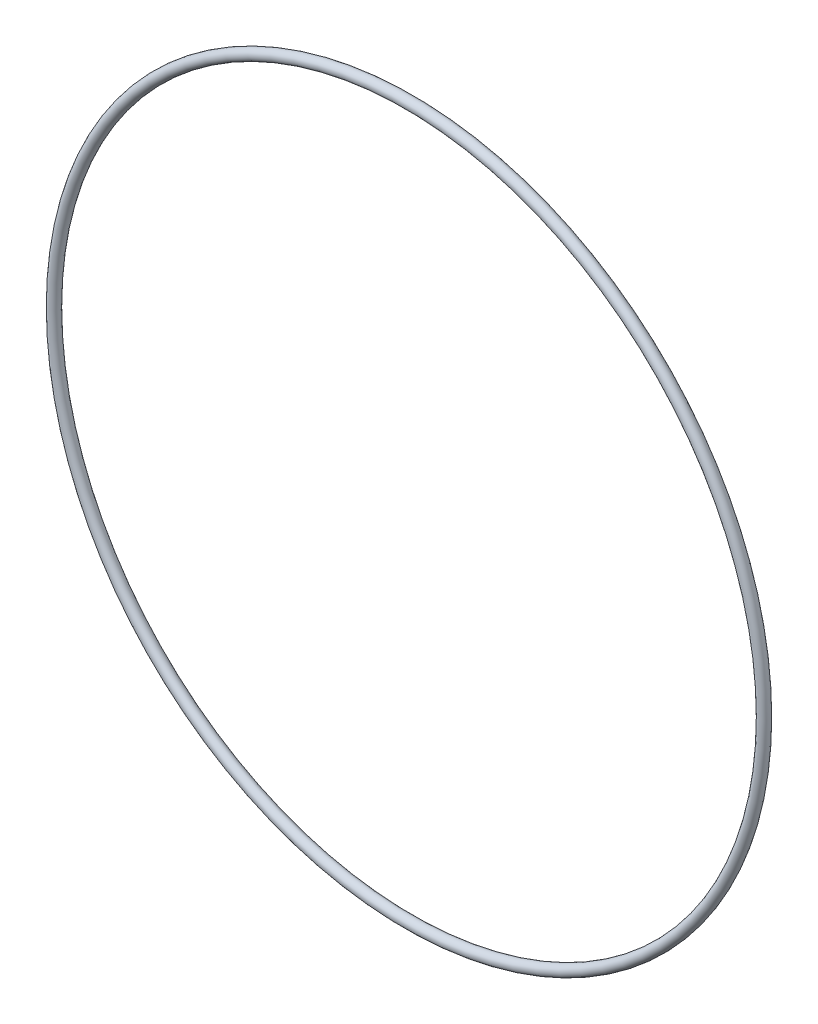
ISO-10303-21;
HEADER;
FILE_DESCRIPTION(('STEP AP214'),'2;1');
FILE_NAME('part.step','',(''),(''),'','','');
FILE_SCHEMA(('AUTOMOTIVE_DESIGN { 1 0 10303 214 1 1 1 1 }'));
ENDSEC;
DATA;
#1=APPLICATION_CONTEXT('core data for automotive mechanical design processes');
#2=APPLICATION_PROTOCOL_DEFINITION('international standard','automotive_design',2000,#1);
#3=PRODUCT_CONTEXT('',#1,'mechanical');
#4=PRODUCT('Part','Part','',(#3));
#5=PRODUCT_RELATED_PRODUCT_CATEGORY('part','',(#4));
#6=PRODUCT_DEFINITION_FORMATION('','',#4);
#7=PRODUCT_DEFINITION_CONTEXT('part definition',#1,'design');
#8=PRODUCT_DEFINITION('design','',#6,#7);
#9=PRODUCT_DEFINITION_SHAPE('','',#8);
#10=(LENGTH_UNIT() NAMED_UNIT(*) SI_UNIT(.MILLI.,.METRE.));
#11=(NAMED_UNIT(*) PLANE_ANGLE_UNIT() SI_UNIT($,.RADIAN.));
#12=(NAMED_UNIT(*) SI_UNIT($,.STERADIAN.) SOLID_ANGLE_UNIT());
#13=UNCERTAINTY_MEASURE_WITH_UNIT(LENGTH_MEASURE(1.E-05),#10,'distance_accuracy_value','');
#14=(GEOMETRIC_REPRESENTATION_CONTEXT(3) GLOBAL_UNCERTAINTY_ASSIGNED_CONTEXT((#13)) GLOBAL_UNIT_ASSIGNED_CONTEXT((#10,
#11,#12)) REPRESENTATION_CONTEXT('',''));
#15=CARTESIAN_POINT('',(0.,0.,0.));
#16=DIRECTION('',(0.,0.,1.));
#17=DIRECTION('',(1.,0.,0.));
#18=AXIS2_PLACEMENT_3D('',#15,#16,#17);
#19=CARTESIAN_POINT('',(0.,0.,0.));
#20=DIRECTION('',(0.,0.,1.));
#21=DIRECTION('',(1.,0.,0.));
#22=AXIS2_PLACEMENT_3D('',#19,#20,#21);
#23=TOROIDAL_SURFACE('',#22,57.8993,0.889000000000003);
#24=CARTESIAN_POINT('',(58.7883,0.,0.));
#25=VERTEX_POINT('',#24);
#26=VERTEX_LOOP('',#25);
#27=FACE_BOUND('',#26,.T.);
#28=ADVANCED_FACE('F30',(#27),#23,.T.);
#29=CLOSED_SHELL('',(#28));
#30=MANIFOLD_SOLID_BREP('B2',#29);
#31=ADVANCED_BREP_SHAPE_REPRESENTATION('',(#18,#30),#14);
#32=SHAPE_DEFINITION_REPRESENTATION(#9,#31);
ENDSEC;
END-ISO-10303-21;
